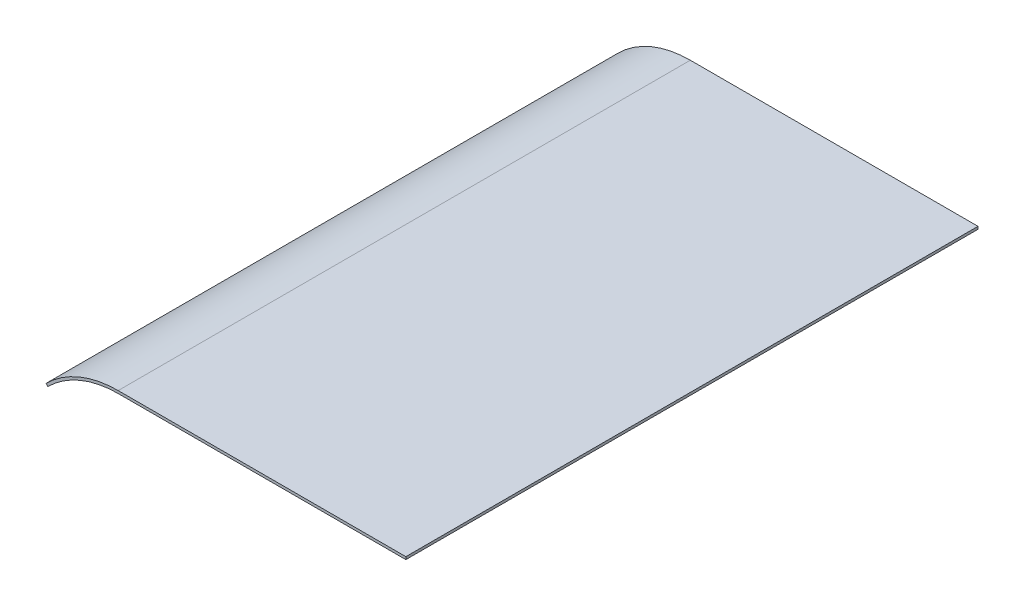
ISO-10303-21;
HEADER;
FILE_DESCRIPTION(('STEP AP214'),'2;1');
FILE_NAME('part.step','',(''),(''),'','','');
FILE_SCHEMA(('AUTOMOTIVE_DESIGN { 1 0 10303 214 1 1 1 1 }'));
ENDSEC;
DATA;
#1=APPLICATION_CONTEXT('core data for automotive mechanical design processes');
#2=APPLICATION_PROTOCOL_DEFINITION('international standard','automotive_design',2000,#1);
#3=PRODUCT_CONTEXT('',#1,'mechanical');
#4=PRODUCT('Part','Part','',(#3));
#5=PRODUCT_RELATED_PRODUCT_CATEGORY('part','',(#4));
#6=PRODUCT_DEFINITION_FORMATION('','',#4);
#7=PRODUCT_DEFINITION_CONTEXT('part definition',#1,'design');
#8=PRODUCT_DEFINITION('design','',#6,#7);
#9=PRODUCT_DEFINITION_SHAPE('','',#8);
#10=(LENGTH_UNIT() NAMED_UNIT(*) SI_UNIT(.MILLI.,.METRE.));
#11=(NAMED_UNIT(*) PLANE_ANGLE_UNIT() SI_UNIT($,.RADIAN.));
#12=(NAMED_UNIT(*) SI_UNIT($,.STERADIAN.) SOLID_ANGLE_UNIT());
#13=UNCERTAINTY_MEASURE_WITH_UNIT(LENGTH_MEASURE(1.E-05),#10,'distance_accuracy_value','');
#14=(GEOMETRIC_REPRESENTATION_CONTEXT(3) GLOBAL_UNCERTAINTY_ASSIGNED_CONTEXT((#13)) GLOBAL_UNIT_ASSIGNED_CONTEXT((#10,
#11,#12)) REPRESENTATION_CONTEXT('',''));
#15=CARTESIAN_POINT('',(0.,0.,0.));
#16=DIRECTION('',(0.,0.,1.));
#17=DIRECTION('',(1.,0.,0.));
#18=AXIS2_PLACEMENT_3D('',#15,#16,#17);
#19=CARTESIAN_POINT('',(-584.199999999973,905.024825288131,165.1));
#20=DIRECTION('',(0.,0.,-1.));
#21=DIRECTION('',(-1.,0.,0.));
#22=AXIS2_PLACEMENT_3D('',#19,#20,#21);
#23=CYLINDRICAL_SURFACE('',#22,58.9051747118684);
#24=CARTESIAN_POINT('',(-584.199999999973,905.024825288131,-165.1));
#25=DIRECTION('',(0.,0.,1.));
#26=DIRECTION('',(1.,0.,0.));
#27=AXIS2_PLACEMENT_3D('',#24,#25,#26);
#28=CIRCLE('',#27,58.9051747118684);
#29=CARTESIAN_POINT('',(-584.199999999973,963.93,-165.1));
#30=VERTEX_POINT('',#29);
#31=CARTESIAN_POINT('',(-625.852248485713,946.677073773872,-165.1));
#32=VERTEX_POINT('',#31);
#33=EDGE_CURVE('E125',#30,#32,#28,.T.);
#34=ORIENTED_EDGE('',*,*,#33,.T.);
#35=DIRECTION('',(0.,0.,-1.));
#36=VECTOR('',#35,1.);
#37=CARTESIAN_POINT('',(-625.852248485713,946.677073773872,165.1));
#38=LINE('',#37,#36);
#39=CARTESIAN_POINT('',(-625.852248485713,946.677073773872,165.1));
#40=VERTEX_POINT('',#39);
#41=EDGE_CURVE('E11',#40,#32,#38,.T.);
#42=ORIENTED_EDGE('',*,*,#41,.F.);
#43=CARTESIAN_POINT('',(-584.199999999973,905.024825288131,165.1));
#44=DIRECTION('',(0.,0.,1.));
#45=DIRECTION('',(1.,0.,0.));
#46=AXIS2_PLACEMENT_3D('',#43,#44,#45);
#47=CIRCLE('',#46,58.9051747118684);
#48=CARTESIAN_POINT('',(-584.199999999973,963.93,165.1));
#49=VERTEX_POINT('',#48);
#50=EDGE_CURVE('E90',#49,#40,#47,.T.);
#51=ORIENTED_EDGE('',*,*,#50,.F.);
#52=DIRECTION('',(0.,0.,-1.));
#53=VECTOR('',#52,1.);
#54=CARTESIAN_POINT('',(-584.199999999973,963.93,165.1));
#55=LINE('',#54,#53);
#56=EDGE_CURVE('E121',#49,#30,#55,.T.);
#57=ORIENTED_EDGE('',*,*,#56,.T.);
#58=EDGE_LOOP('',(#34,#42,#51,#57));
#59=FACE_BOUND('',#58,.T.);
#60=ADVANCED_FACE('F39',(#59),#23,.T.);
#61=CARTESIAN_POINT('',(-624.791588313934,945.616413602092,165.1));
#62=DIRECTION('',(-0.707106781186548,-0.707106781186548,0.));
#63=DIRECTION('',(0.707106781186548,-0.707106781186548,0.));
#64=AXIS2_PLACEMENT_3D('',#61,#62,#63);
#65=PLANE('',#64);
#66=DIRECTION('',(-0.707106781186548,0.707106781186548,0.));
#67=VECTOR('',#66,1.);
#68=CARTESIAN_POINT('',(-624.791588313934,945.616413602092,-165.1));
#69=LINE('',#68,#67);
#70=CARTESIAN_POINT('',(-624.791588313934,945.616413602092,-165.1));
#71=VERTEX_POINT('',#70);
#72=EDGE_CURVE('E129',#71,#32,#69,.T.);
#73=ORIENTED_EDGE('',*,*,#72,.F.);
#74=DIRECTION('',(0.,0.,-1.));
#75=VECTOR('',#74,1.);
#76=CARTESIAN_POINT('',(-624.791588313934,945.616413602092,165.1));
#77=LINE('',#76,#75);
#78=CARTESIAN_POINT('',(-624.791588313934,945.616413602092,165.1));
#79=VERTEX_POINT('',#78);
#80=EDGE_CURVE('E48',#79,#71,#77,.T.);
#81=ORIENTED_EDGE('',*,*,#80,.F.);
#82=DIRECTION('',(-0.707106781186548,0.707106781186548,0.));
#83=VECTOR('',#82,1.);
#84=CARTESIAN_POINT('',(-624.791588313934,945.616413602092,165.1));
#85=LINE('',#84,#83);
#86=EDGE_CURVE('E227',#79,#40,#85,.T.);
#87=ORIENTED_EDGE('',*,*,#86,.T.);
#88=ORIENTED_EDGE('',*,*,#41,.T.);
#89=EDGE_LOOP('',(#73,#81,#87,#88));
#90=FACE_BOUND('',#89,.T.);
#91=ADVANCED_FACE('F154',(#90),#65,.T.);
#92=CARTESIAN_POINT('',(-584.199999999973,905.024825288131,165.1));
#93=DIRECTION('',(0.,0.,-1.));
#94=DIRECTION('',(-1.,0.,0.));
#95=AXIS2_PLACEMENT_3D('',#92,#93,#94);
#96=CYLINDRICAL_SURFACE('',#95,57.4051747118684);
#97=CARTESIAN_POINT('',(-584.199999999973,905.024825288131,-165.1));
#98=DIRECTION('',(0.,0.,1.));
#99=DIRECTION('',(1.,0.,0.));
#100=AXIS2_PLACEMENT_3D('',#97,#98,#99);
#101=CIRCLE('',#100,57.4051747118684);
#102=CARTESIAN_POINT('',(-584.199999999973,962.43,-165.1));
#103=VERTEX_POINT('',#102);
#104=EDGE_CURVE('E133',#103,#71,#101,.T.);
#105=ORIENTED_EDGE('',*,*,#104,.F.);
#106=DIRECTION('',(0.,0.,-1.));
#107=VECTOR('',#106,1.);
#108=CARTESIAN_POINT('',(-584.199999999973,962.43,165.1));
#109=LINE('',#108,#107);
#110=CARTESIAN_POINT('',(-584.199999999973,962.43,165.1));
#111=VERTEX_POINT('',#110);
#112=EDGE_CURVE('E111',#111,#103,#109,.T.);
#113=ORIENTED_EDGE('',*,*,#112,.F.);
#114=CARTESIAN_POINT('',(-584.199999999973,905.024825288131,165.1));
#115=DIRECTION('',(0.,0.,1.));
#116=DIRECTION('',(1.,0.,0.));
#117=AXIS2_PLACEMENT_3D('',#114,#115,#116);
#118=CIRCLE('',#117,57.4051747118684);
#119=EDGE_CURVE('E117',#111,#79,#118,.T.);
#120=ORIENTED_EDGE('',*,*,#119,.T.);
#121=ORIENTED_EDGE('',*,*,#80,.T.);
#122=EDGE_LOOP('',(#105,#113,#120,#121));
#123=FACE_BOUND('',#122,.T.);
#124=ADVANCED_FACE('F151',(#123),#96,.F.);
#125=CARTESIAN_POINT('',(-418.175,962.43,165.1));
#126=DIRECTION('',(0.,-1.,0.));
#127=DIRECTION('',(1.,0.,0.));
#128=AXIS2_PLACEMENT_3D('',#125,#126,#127);
#129=PLANE('',#128);
#130=DIRECTION('',(-1.,0.,0.));
#131=VECTOR('',#130,1.);
#132=CARTESIAN_POINT('',(-418.175,962.43,-165.1));
#133=LINE('',#132,#131);
#134=CARTESIAN_POINT('',(-418.175,962.43,-165.1));
#135=VERTEX_POINT('',#134);
#136=EDGE_CURVE('E106',#135,#103,#133,.T.);
#137=ORIENTED_EDGE('',*,*,#136,.F.);
#138=DIRECTION('',(0.,0.,-1.));
#139=VECTOR('',#138,1.);
#140=CARTESIAN_POINT('',(-418.175,962.43,165.1));
#141=LINE('',#140,#139);
#142=CARTESIAN_POINT('',(-418.175,962.43,165.1));
#143=VERTEX_POINT('',#142);
#144=EDGE_CURVE('E101',#143,#135,#141,.T.);
#145=ORIENTED_EDGE('',*,*,#144,.F.);
#146=DIRECTION('',(-1.,0.,0.));
#147=VECTOR('',#146,1.);
#148=CARTESIAN_POINT('',(-418.175,962.43,165.1));
#149=LINE('',#148,#147);
#150=EDGE_CURVE('E104',#143,#111,#149,.T.);
#151=ORIENTED_EDGE('',*,*,#150,.T.);
#152=ORIENTED_EDGE('',*,*,#112,.T.);
#153=EDGE_LOOP('',(#137,#145,#151,#152));
#154=FACE_BOUND('',#153,.T.);
#155=ADVANCED_FACE('F103',(#154),#129,.T.);
#156=CARTESIAN_POINT('',(-418.175,963.93,165.1));
#157=DIRECTION('',(1.,0.,0.));
#158=DIRECTION('',(0.,0.,-1.));
#159=AXIS2_PLACEMENT_3D('',#156,#157,#158);
#160=PLANE('',#159);
#161=DIRECTION('',(0.,-1.,0.));
#162=VECTOR('',#161,1.);
#163=CARTESIAN_POINT('',(-418.175,963.93,-165.1));
#164=LINE('',#163,#162);
#165=CARTESIAN_POINT('',(-418.175,963.93,-165.1));
#166=VERTEX_POINT('',#165);
#167=EDGE_CURVE('E139',#166,#135,#164,.T.);
#168=ORIENTED_EDGE('',*,*,#167,.F.);
#169=DIRECTION('',(0.,0.,-1.));
#170=VECTOR('',#169,1.);
#171=CARTESIAN_POINT('',(-418.175,963.93,165.1));
#172=LINE('',#171,#170);
#173=CARTESIAN_POINT('',(-418.175,963.93,165.1));
#174=VERTEX_POINT('',#173);
#175=EDGE_CURVE('E80',#174,#166,#172,.T.);
#176=ORIENTED_EDGE('',*,*,#175,.F.);
#177=DIRECTION('',(0.,-1.,0.));
#178=VECTOR('',#177,1.);
#179=CARTESIAN_POINT('',(-418.175,963.93,165.1));
#180=LINE('',#179,#178);
#181=EDGE_CURVE('E115',#174,#143,#180,.T.);
#182=ORIENTED_EDGE('',*,*,#181,.T.);
#183=ORIENTED_EDGE('',*,*,#144,.T.);
#184=EDGE_LOOP('',(#168,#176,#182,#183));
#185=FACE_BOUND('',#184,.T.);
#186=ADVANCED_FACE('F119',(#185),#160,.T.);
#187=CARTESIAN_POINT('',(-418.175,963.93,165.1));
#188=DIRECTION('',(0.,-1.,0.));
#189=DIRECTION('',(1.,0.,0.));
#190=AXIS2_PLACEMENT_3D('',#187,#188,#189);
#191=PLANE('',#190);
#192=DIRECTION('',(-1.,0.,0.));
#193=VECTOR('',#192,1.);
#194=CARTESIAN_POINT('',(-418.175,963.93,-165.1));
#195=LINE('',#194,#193);
#196=EDGE_CURVE('E84',#166,#30,#195,.T.);
#197=ORIENTED_EDGE('',*,*,#196,.T.);
#198=ORIENTED_EDGE('',*,*,#56,.F.);
#199=DIRECTION('',(-1.,0.,0.));
#200=VECTOR('',#199,1.);
#201=CARTESIAN_POINT('',(-418.175,963.93,165.1));
#202=LINE('',#201,#200);
#203=EDGE_CURVE('E56',#174,#49,#202,.T.);
#204=ORIENTED_EDGE('',*,*,#203,.F.);
#205=ORIENTED_EDGE('',*,*,#175,.T.);
#206=EDGE_LOOP('',(#197,#198,#204,#205));
#207=FACE_BOUND('',#206,.T.);
#208=ADVANCED_FACE('F159',(#207),#191,.F.);
#209=CARTESIAN_POINT('',(-584.199999999973,905.024825288131,165.1));
#210=DIRECTION('',(0.,0.,1.));
#211=DIRECTION('',(1.,0.,0.));
#212=AXIS2_PLACEMENT_3D('',#209,#210,#211);
#213=PLANE('',#212);
#214=ORIENTED_EDGE('',*,*,#50,.T.);
#215=ORIENTED_EDGE('',*,*,#86,.F.);
#216=ORIENTED_EDGE('',*,*,#119,.F.);
#217=ORIENTED_EDGE('',*,*,#150,.F.);
#218=ORIENTED_EDGE('',*,*,#181,.F.);
#219=ORIENTED_EDGE('',*,*,#203,.T.);
#220=EDGE_LOOP('',(#214,#215,#216,#217,#218,#219));
#221=FACE_BOUND('',#220,.T.);
#222=ADVANCED_FACE('F114',(#221),#213,.T.);
#223=CARTESIAN_POINT('',(-584.199999999973,905.024825288131,-165.1));
#224=DIRECTION('',(0.,0.,1.));
#225=DIRECTION('',(1.,0.,0.));
#226=AXIS2_PLACEMENT_3D('',#223,#224,#225);
#227=PLANE('',#226);
#228=ORIENTED_EDGE('',*,*,#33,.F.);
#229=ORIENTED_EDGE('',*,*,#196,.F.);
#230=ORIENTED_EDGE('',*,*,#167,.T.);
#231=ORIENTED_EDGE('',*,*,#136,.T.);
#232=ORIENTED_EDGE('',*,*,#104,.T.);
#233=ORIENTED_EDGE('',*,*,#72,.T.);
#234=EDGE_LOOP('',(#228,#229,#230,#231,#232,#233));
#235=FACE_BOUND('',#234,.T.);
#236=ADVANCED_FACE('F157',(#235),#227,.F.);
#237=CLOSED_SHELL('',(#60,#91,#124,#155,#186,#208,#222,#236));
#238=MANIFOLD_SOLID_BREP('B2',#237);
#239=ADVANCED_BREP_SHAPE_REPRESENTATION('',(#18,#238),#14);
#240=SHAPE_DEFINITION_REPRESENTATION(#9,#239);
ENDSEC;
END-ISO-10303-21;
